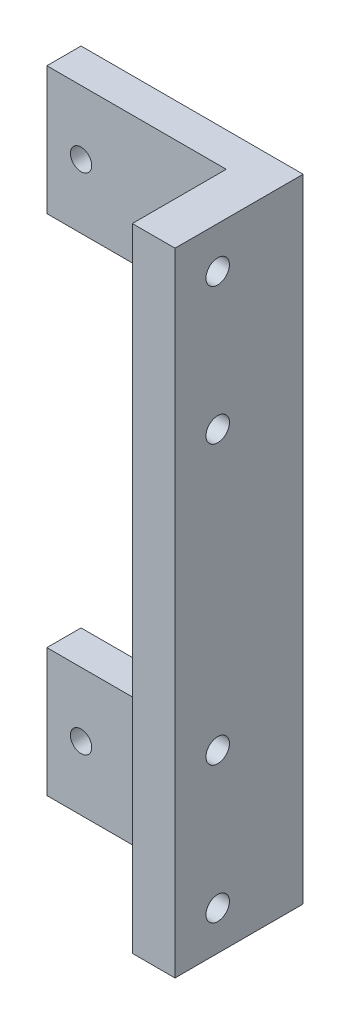
ISO-10303-21;
HEADER;
FILE_DESCRIPTION(('STEP AP214'),'2;1');
FILE_NAME('part.step','',(''),(''),'','','');
FILE_SCHEMA(('AUTOMOTIVE_DESIGN { 1 0 10303 214 1 1 1 1 }'));
ENDSEC;
DATA;
#1=APPLICATION_CONTEXT('core data for automotive mechanical design processes');
#2=APPLICATION_PROTOCOL_DEFINITION('international standard','automotive_design',2000,#1);
#3=PRODUCT_CONTEXT('',#1,'mechanical');
#4=PRODUCT('Part','Part','',(#3));
#5=PRODUCT_RELATED_PRODUCT_CATEGORY('part','',(#4));
#6=PRODUCT_DEFINITION_FORMATION('','',#4);
#7=PRODUCT_DEFINITION_CONTEXT('part definition',#1,'design');
#8=PRODUCT_DEFINITION('design','',#6,#7);
#9=PRODUCT_DEFINITION_SHAPE('','',#8);
#10=(LENGTH_UNIT() NAMED_UNIT(*) SI_UNIT(.MILLI.,.METRE.));
#11=(NAMED_UNIT(*) PLANE_ANGLE_UNIT() SI_UNIT($,.RADIAN.));
#12=(NAMED_UNIT(*) SI_UNIT($,.STERADIAN.) SOLID_ANGLE_UNIT());
#13=UNCERTAINTY_MEASURE_WITH_UNIT(LENGTH_MEASURE(1.E-05),#10,'distance_accuracy_value','');
#14=(GEOMETRIC_REPRESENTATION_CONTEXT(3) GLOBAL_UNCERTAINTY_ASSIGNED_CONTEXT((#13)) GLOBAL_UNIT_ASSIGNED_CONTEXT((#10,
#11,#12)) REPRESENTATION_CONTEXT('',''));
#15=CARTESIAN_POINT('',(0.,0.,0.));
#16=DIRECTION('',(0.,0.,1.));
#17=DIRECTION('',(1.,0.,0.));
#18=AXIS2_PLACEMENT_3D('',#15,#16,#17);
#19=CARTESIAN_POINT('',(0.,148.,8.));
#20=DIRECTION('',(0.,-1.,0.));
#21=DIRECTION('',(0.,0.,-1.));
#22=AXIS2_PLACEMENT_3D('',#19,#20,#21);
#23=PLANE('',#22);
#24=DIRECTION('',(-1.,0.,0.));
#25=VECTOR('',#24,1.);
#26=CARTESIAN_POINT('',(0.,148.,0.));
#27=LINE('',#26,#25);
#28=CARTESIAN_POINT('',(52.,148.,0.));
#29=VERTEX_POINT('',#28);
#30=CARTESIAN_POINT('',(0.,148.,0.));
#31=VERTEX_POINT('',#30);
#32=EDGE_CURVE('E114',#29,#31,#27,.T.);
#33=ORIENTED_EDGE('',*,*,#32,.T.);
#34=DIRECTION('',(0.,0.,-1.));
#35=VECTOR('',#34,1.);
#36=CARTESIAN_POINT('',(0.,148.,8.));
#37=LINE('',#36,#35);
#38=CARTESIAN_POINT('',(0.,148.,8.));
#39=VERTEX_POINT('',#38);
#40=EDGE_CURVE('E11',#39,#31,#37,.T.);
#41=ORIENTED_EDGE('',*,*,#40,.F.);
#42=DIRECTION('',(-1.,0.,0.));
#43=VECTOR('',#42,1.);
#44=CARTESIAN_POINT('',(0.,148.,8.));
#45=LINE('',#44,#43);
#46=CARTESIAN_POINT('',(42.,148.,8.));
#47=VERTEX_POINT('',#46);
#48=EDGE_CURVE('E96',#47,#39,#45,.T.);
#49=ORIENTED_EDGE('',*,*,#48,.F.);
#50=DIRECTION('',(0.,0.,-1.));
#51=VECTOR('',#50,1.);
#52=CARTESIAN_POINT('',(42.,148.,30.));
#53=LINE('',#52,#51);
#54=CARTESIAN_POINT('',(42.,148.,30.));
#55=VERTEX_POINT('',#54);
#56=EDGE_CURVE('E142',#55,#47,#53,.T.);
#57=ORIENTED_EDGE('',*,*,#56,.F.);
#58=DIRECTION('',(1.,0.,0.));
#59=VECTOR('',#58,1.);
#60=CARTESIAN_POINT('',(0.,148.,30.));
#61=LINE('',#60,#59);
#62=CARTESIAN_POINT('',(52.,148.,30.));
#63=VERTEX_POINT('',#62);
#64=EDGE_CURVE('E173',#55,#63,#61,.T.);
#65=ORIENTED_EDGE('',*,*,#64,.T.);
#66=DIRECTION('',(0.,0.,-1.));
#67=VECTOR('',#66,1.);
#68=CARTESIAN_POINT('',(52.,148.,30.));
#69=LINE('',#68,#67);
#70=EDGE_CURVE('E149',#63,#29,#69,.T.);
#71=ORIENTED_EDGE('',*,*,#70,.T.);
#72=EDGE_LOOP('',(#33,#41,#49,#57,#65,#71));
#73=FACE_BOUND('',#72,.T.);
#74=ADVANCED_FACE('F40',(#73),#23,.F.);
#75=CARTESIAN_POINT('',(0.,0.,8.));
#76=DIRECTION('',(1.,0.,0.));
#77=DIRECTION('',(0.,1.,0.));
#78=AXIS2_PLACEMENT_3D('',#75,#76,#77);
#79=PLANE('',#78);
#80=DIRECTION('',(0.,-1.,0.));
#81=VECTOR('',#80,1.);
#82=CARTESIAN_POINT('',(0.,0.,0.));
#83=LINE('',#82,#81);
#84=CARTESIAN_POINT('',(0.,118.,0.));
#85=VERTEX_POINT('',#84);
#86=EDGE_CURVE('E73',#31,#85,#83,.T.);
#87=ORIENTED_EDGE('',*,*,#86,.T.);
#88=DIRECTION('',(0.,0.,-1.));
#89=VECTOR('',#88,1.);
#90=CARTESIAN_POINT('',(0.,118.,8.));
#91=LINE('',#90,#89);
#92=CARTESIAN_POINT('',(0.,118.,8.));
#93=VERTEX_POINT('',#92);
#94=EDGE_CURVE('E51',#93,#85,#91,.T.);
#95=ORIENTED_EDGE('',*,*,#94,.F.);
#96=DIRECTION('',(0.,-1.,0.));
#97=VECTOR('',#96,1.);
#98=CARTESIAN_POINT('',(0.,0.,8.));
#99=LINE('',#98,#97);
#100=EDGE_CURVE('E91',#39,#93,#99,.T.);
#101=ORIENTED_EDGE('',*,*,#100,.F.);
#102=ORIENTED_EDGE('',*,*,#40,.T.);
#103=EDGE_LOOP('',(#87,#95,#101,#102));
#104=FACE_BOUND('',#103,.T.);
#105=ADVANCED_FACE('F101',(#104),#79,.F.);
#106=CARTESIAN_POINT('',(0.,118.,8.));
#107=DIRECTION('',(0.,-1.,0.));
#108=DIRECTION('',(0.,0.,-1.));
#109=AXIS2_PLACEMENT_3D('',#106,#107,#108);
#110=PLANE('',#109);
#111=DIRECTION('',(-1.,0.,0.));
#112=VECTOR('',#111,1.);
#113=CARTESIAN_POINT('',(0.,118.,0.));
#114=LINE('',#113,#112);
#115=CARTESIAN_POINT('',(42.,118.,0.));
#116=VERTEX_POINT('',#115);
#117=EDGE_CURVE('E121',#116,#85,#114,.T.);
#118=ORIENTED_EDGE('',*,*,#117,.F.);
#119=DIRECTION('',(0.,0.,-1.));
#120=VECTOR('',#119,1.);
#121=CARTESIAN_POINT('',(42.,118.,8.));
#122=LINE('',#121,#120);
#123=CARTESIAN_POINT('',(42.,118.,8.));
#124=VERTEX_POINT('',#123);
#125=EDGE_CURVE('E104',#124,#116,#122,.T.);
#126=ORIENTED_EDGE('',*,*,#125,.F.);
#127=DIRECTION('',(-1.,0.,0.));
#128=VECTOR('',#127,1.);
#129=CARTESIAN_POINT('',(0.,118.,8.));
#130=LINE('',#129,#128);
#131=EDGE_CURVE('E95',#124,#93,#130,.T.);
#132=ORIENTED_EDGE('',*,*,#131,.T.);
#133=ORIENTED_EDGE('',*,*,#94,.T.);
#134=EDGE_LOOP('',(#118,#126,#132,#133));
#135=FACE_BOUND('',#134,.T.);
#136=ADVANCED_FACE('F106',(#135),#110,.T.);
#137=CARTESIAN_POINT('',(0.,0.,8.));
#138=DIRECTION('',(0.,0.,1.));
#139=DIRECTION('',(1.,0.,0.));
#140=AXIS2_PLACEMENT_3D('',#137,#138,#139);
#141=PLANE('',#140);
#142=CARTESIAN_POINT('',(34.,133.,8.));
#143=DIRECTION('',(0.,0.,1.));
#144=DIRECTION('',(1.,0.,0.));
#145=AXIS2_PLACEMENT_3D('',#142,#143,#144);
#146=CIRCLE('',#145,2.5);
#147=CARTESIAN_POINT('',(36.5,133.,8.));
#148=VERTEX_POINT('',#147);
#149=EDGE_CURVE('E230',#148,#148,#146,.T.);
#150=ORIENTED_EDGE('',*,*,#149,.F.);
#151=EDGE_LOOP('',(#150));
#152=FACE_BOUND('',#151,.T.);
#153=CARTESIAN_POINT('',(7.99999999999999,133.,8.));
#154=DIRECTION('',(0.,0.,1.));
#155=DIRECTION('',(1.,0.,0.));
#156=AXIS2_PLACEMENT_3D('',#153,#154,#155);
#157=CIRCLE('',#156,2.5);
#158=CARTESIAN_POINT('',(10.5,133.,8.));
#159=VERTEX_POINT('',#158);
#160=EDGE_CURVE('E222',#159,#159,#157,.T.);
#161=ORIENTED_EDGE('',*,*,#160,.F.);
#162=EDGE_LOOP('',(#161));
#163=FACE_BOUND('',#162,.T.);
#164=ORIENTED_EDGE('',*,*,#48,.T.);
#165=ORIENTED_EDGE('',*,*,#100,.T.);
#166=ORIENTED_EDGE('',*,*,#131,.F.);
#167=DIRECTION('',(0.,1.,0.));
#168=VECTOR('',#167,1.);
#169=CARTESIAN_POINT('',(42.,0.,8.));
#170=LINE('',#169,#168);
#171=EDGE_CURVE('E60',#124,#47,#170,.T.);
#172=ORIENTED_EDGE('',*,*,#171,.T.);
#173=EDGE_LOOP('',(#164,#165,#166,#172));
#174=FACE_BOUND('',#173,.T.);
#175=ADVANCED_FACE('F93',(#152,#163,#174),#141,.T.);
#176=CARTESIAN_POINT('',(0.,0.,0.));
#177=DIRECTION('',(0.,0.,1.));
#178=DIRECTION('',(1.,0.,0.));
#179=AXIS2_PLACEMENT_3D('',#176,#177,#178);
#180=PLANE('',#179);
#181=CARTESIAN_POINT('',(7.99999999999999,15.,0.));
#182=DIRECTION('',(0.,0.,1.));
#183=DIRECTION('',(1.,0.,0.));
#184=AXIS2_PLACEMENT_3D('',#181,#182,#183);
#185=CIRCLE('',#184,2.5);
#186=CARTESIAN_POINT('',(10.5,15.,0.));
#187=VERTEX_POINT('',#186);
#188=EDGE_CURVE('E242',#187,#187,#185,.F.);
#189=ORIENTED_EDGE('',*,*,#188,.F.);
#190=EDGE_LOOP('',(#189));
#191=FACE_BOUND('',#190,.T.);
#192=CARTESIAN_POINT('',(34.,15.,0.));
#193=DIRECTION('',(0.,0.,1.));
#194=DIRECTION('',(1.,0.,0.));
#195=AXIS2_PLACEMENT_3D('',#192,#193,#194);
#196=CIRCLE('',#195,2.5);
#197=CARTESIAN_POINT('',(36.5,15.,0.));
#198=VERTEX_POINT('',#197);
#199=EDGE_CURVE('E234',#198,#198,#196,.F.);
#200=ORIENTED_EDGE('',*,*,#199,.F.);
#201=EDGE_LOOP('',(#200));
#202=FACE_BOUND('',#201,.T.);
#203=CARTESIAN_POINT('',(34.,133.,0.));
#204=DIRECTION('',(0.,0.,1.));
#205=DIRECTION('',(1.,0.,0.));
#206=AXIS2_PLACEMENT_3D('',#203,#204,#205);
#207=CIRCLE('',#206,2.5);
#208=CARTESIAN_POINT('',(36.5,133.,0.));
#209=VERTEX_POINT('',#208);
#210=EDGE_CURVE('E226',#209,#209,#207,.F.);
#211=ORIENTED_EDGE('',*,*,#210,.F.);
#212=EDGE_LOOP('',(#211));
#213=FACE_BOUND('',#212,.T.);
#214=CARTESIAN_POINT('',(7.99999999999999,133.,0.));
#215=DIRECTION('',(0.,0.,1.));
#216=DIRECTION('',(1.,0.,0.));
#217=AXIS2_PLACEMENT_3D('',#214,#215,#216);
#218=CIRCLE('',#217,2.5);
#219=CARTESIAN_POINT('',(10.5,133.,0.));
#220=VERTEX_POINT('',#219);
#221=EDGE_CURVE('E204',#220,#220,#218,.F.);
#222=ORIENTED_EDGE('',*,*,#221,.F.);
#223=EDGE_LOOP('',(#222));
#224=FACE_BOUND('',#223,.T.);
#225=ORIENTED_EDGE('',*,*,#32,.F.);
#226=DIRECTION('',(0.,1.,0.));
#227=VECTOR('',#226,1.);
#228=CARTESIAN_POINT('',(52.,0.,0.));
#229=LINE('',#228,#227);
#230=CARTESIAN_POINT('',(52.,0.,0.));
#231=VERTEX_POINT('',#230);
#232=EDGE_CURVE('E162',#231,#29,#229,.T.);
#233=ORIENTED_EDGE('',*,*,#232,.F.);
#234=DIRECTION('',(1.,0.,0.));
#235=VECTOR('',#234,1.);
#236=CARTESIAN_POINT('',(0.,0.,0.));
#237=LINE('',#236,#235);
#238=CARTESIAN_POINT('',(0.,0.,0.));
#239=VERTEX_POINT('',#238);
#240=EDGE_CURVE('E166',#239,#231,#237,.T.);
#241=ORIENTED_EDGE('',*,*,#240,.F.);
#242=DIRECTION('',(0.,1.,0.));
#243=VECTOR('',#242,1.);
#244=CARTESIAN_POINT('',(0.,0.,0.));
#245=LINE('',#244,#243);
#246=CARTESIAN_POINT('',(0.,30.,0.));
#247=VERTEX_POINT('',#246);
#248=EDGE_CURVE('E196',#239,#247,#245,.T.);
#249=ORIENTED_EDGE('',*,*,#248,.T.);
#250=DIRECTION('',(1.,0.,0.));
#251=VECTOR('',#250,1.);
#252=CARTESIAN_POINT('',(0.,30.,0.));
#253=LINE('',#252,#251);
#254=CARTESIAN_POINT('',(42.,30.,0.));
#255=VERTEX_POINT('',#254);
#256=EDGE_CURVE('E201',#247,#255,#253,.T.);
#257=ORIENTED_EDGE('',*,*,#256,.T.);
#258=DIRECTION('',(0.,1.,0.));
#259=VECTOR('',#258,1.);
#260=CARTESIAN_POINT('',(42.,0.,0.));
#261=LINE('',#260,#259);
#262=EDGE_CURVE('E43',#255,#116,#261,.T.);
#263=ORIENTED_EDGE('',*,*,#262,.T.);
#264=ORIENTED_EDGE('',*,*,#117,.T.);
#265=ORIENTED_EDGE('',*,*,#86,.F.);
#266=EDGE_LOOP('',(#225,#233,#241,#249,#257,#263,#264,#265));
#267=FACE_BOUND('',#266,.T.);
#268=ADVANCED_FACE('F134',(#191,#202,#213,#224,#267),#180,.F.);
#269=CARTESIAN_POINT('',(42.,0.,30.));
#270=DIRECTION('',(-1.,0.,0.));
#271=DIRECTION('',(0.,-1.,0.));
#272=AXIS2_PLACEMENT_3D('',#269,#270,#271);
#273=PLANE('',#272);
#274=CARTESIAN_POINT('',(42.,9.20000000000001,20.));
#275=DIRECTION('',(-1.,0.,0.));
#276=DIRECTION('',(0.,-1.,0.));
#277=AXIS2_PLACEMENT_3D('',#274,#275,#276);
#278=CIRCLE('',#277,2.75);
#279=CARTESIAN_POINT('',(42.,6.45000000000002,20.));
#280=VERTEX_POINT('',#279);
#281=EDGE_CURVE('E274',#280,#280,#278,.F.);
#282=ORIENTED_EDGE('',*,*,#281,.T.);
#283=EDGE_LOOP('',(#282));
#284=FACE_BOUND('',#283,.T.);
#285=CARTESIAN_POINT('',(42.,41.2,20.));
#286=DIRECTION('',(-1.,0.,0.));
#287=DIRECTION('',(0.,-1.,0.));
#288=AXIS2_PLACEMENT_3D('',#285,#286,#287);
#289=CIRCLE('',#288,2.75);
#290=CARTESIAN_POINT('',(42.,38.45,20.));
#291=VERTEX_POINT('',#290);
#292=EDGE_CURVE('E266',#291,#291,#289,.F.);
#293=ORIENTED_EDGE('',*,*,#292,.T.);
#294=EDGE_LOOP('',(#293));
#295=FACE_BOUND('',#294,.T.);
#296=CARTESIAN_POINT('',(42.,106.3,20.));
#297=DIRECTION('',(-1.,0.,0.));
#298=DIRECTION('',(0.,-1.,0.));
#299=AXIS2_PLACEMENT_3D('',#296,#297,#298);
#300=CIRCLE('',#299,2.75);
#301=CARTESIAN_POINT('',(42.,103.55,20.));
#302=VERTEX_POINT('',#301);
#303=EDGE_CURVE('E258',#302,#302,#300,.F.);
#304=ORIENTED_EDGE('',*,*,#303,.T.);
#305=EDGE_LOOP('',(#304));
#306=FACE_BOUND('',#305,.T.);
#307=CARTESIAN_POINT('',(42.,138.3,20.));
#308=DIRECTION('',(-1.,0.,0.));
#309=DIRECTION('',(0.,-1.,0.));
#310=AXIS2_PLACEMENT_3D('',#307,#308,#309);
#311=CIRCLE('',#310,2.75);
#312=CARTESIAN_POINT('',(42.,135.55,20.));
#313=VERTEX_POINT('',#312);
#314=EDGE_CURVE('E250',#313,#313,#311,.F.);
#315=ORIENTED_EDGE('',*,*,#314,.T.);
#316=EDGE_LOOP('',(#315));
#317=FACE_BOUND('',#316,.T.);
#318=DIRECTION('',(0.,0.,-1.));
#319=VECTOR('',#318,1.);
#320=CARTESIAN_POINT('',(42.,30.,8.));
#321=LINE('',#320,#319);
#322=CARTESIAN_POINT('',(42.,30.,8.));
#323=VERTEX_POINT('',#322);
#324=EDGE_CURVE('E170',#323,#255,#321,.T.);
#325=ORIENTED_EDGE('',*,*,#324,.F.);
#326=DIRECTION('',(0.,1.,0.));
#327=VECTOR('',#326,1.);
#328=CARTESIAN_POINT('',(42.,0.,8.));
#329=LINE('',#328,#327);
#330=CARTESIAN_POINT('',(42.,0.,8.));
#331=VERTEX_POINT('',#330);
#332=EDGE_CURVE('E212',#331,#323,#329,.T.);
#333=ORIENTED_EDGE('',*,*,#332,.F.);
#334=DIRECTION('',(0.,0.,-1.));
#335=VECTOR('',#334,1.);
#336=CARTESIAN_POINT('',(42.,0.,30.));
#337=LINE('',#336,#335);
#338=CARTESIAN_POINT('',(42.,0.,30.));
#339=VERTEX_POINT('',#338);
#340=EDGE_CURVE('E150',#339,#331,#337,.T.);
#341=ORIENTED_EDGE('',*,*,#340,.F.);
#342=DIRECTION('',(0.,1.,0.));
#343=VECTOR('',#342,1.);
#344=CARTESIAN_POINT('',(42.,0.,30.));
#345=LINE('',#344,#343);
#346=EDGE_CURVE('E144',#339,#55,#345,.T.);
#347=ORIENTED_EDGE('',*,*,#346,.T.);
#348=ORIENTED_EDGE('',*,*,#56,.T.);
#349=ORIENTED_EDGE('',*,*,#171,.F.);
#350=ORIENTED_EDGE('',*,*,#125,.T.);
#351=ORIENTED_EDGE('',*,*,#262,.F.);
#352=EDGE_LOOP('',(#325,#333,#341,#347,#348,#349,#350,#351));
#353=FACE_BOUND('',#352,.T.);
#354=ADVANCED_FACE('F137',(#284,#295,#306,#317,#353),#273,.T.);
#355=CARTESIAN_POINT('',(0.,0.,30.));
#356=DIRECTION('',(0.,1.,0.));
#357=DIRECTION('',(0.,0.,1.));
#358=AXIS2_PLACEMENT_3D('',#355,#356,#357);
#359=PLANE('',#358);
#360=ORIENTED_EDGE('',*,*,#240,.T.);
#361=DIRECTION('',(0.,0.,-1.));
#362=VECTOR('',#361,1.);
#363=CARTESIAN_POINT('',(52.,0.,30.));
#364=LINE('',#363,#362);
#365=CARTESIAN_POINT('',(52.,0.,30.));
#366=VERTEX_POINT('',#365);
#367=EDGE_CURVE('E118',#366,#231,#364,.T.);
#368=ORIENTED_EDGE('',*,*,#367,.F.);
#369=DIRECTION('',(1.,0.,0.));
#370=VECTOR('',#369,1.);
#371=CARTESIAN_POINT('',(0.,0.,30.));
#372=LINE('',#371,#370);
#373=EDGE_CURVE('E180',#339,#366,#372,.T.);
#374=ORIENTED_EDGE('',*,*,#373,.F.);
#375=ORIENTED_EDGE('',*,*,#340,.T.);
#376=DIRECTION('',(1.,0.,0.));
#377=VECTOR('',#376,1.);
#378=CARTESIAN_POINT('',(0.,0.,8.));
#379=LINE('',#378,#377);
#380=CARTESIAN_POINT('',(0.,0.,8.));
#381=VERTEX_POINT('',#380);
#382=EDGE_CURVE('E200',#381,#331,#379,.T.);
#383=ORIENTED_EDGE('',*,*,#382,.F.);
#384=DIRECTION('',(0.,0.,-1.));
#385=VECTOR('',#384,1.);
#386=CARTESIAN_POINT('',(0.,0.,8.));
#387=LINE('',#386,#385);
#388=EDGE_CURVE('E191',#381,#239,#387,.T.);
#389=ORIENTED_EDGE('',*,*,#388,.T.);
#390=EDGE_LOOP('',(#360,#368,#374,#375,#383,#389));
#391=FACE_BOUND('',#390,.T.);
#392=ADVANCED_FACE('F290',(#391),#359,.F.);
#393=CARTESIAN_POINT('',(52.,0.,30.));
#394=DIRECTION('',(-1.,0.,0.));
#395=DIRECTION('',(0.,0.,1.));
#396=AXIS2_PLACEMENT_3D('',#393,#394,#395);
#397=PLANE('',#396);
#398=CARTESIAN_POINT('',(52.,9.20000000000001,20.));
#399=DIRECTION('',(1.,0.,0.));
#400=DIRECTION('',(0.,0.,1.));
#401=AXIS2_PLACEMENT_3D('',#398,#399,#400);
#402=CIRCLE('',#401,2.75);
#403=CARTESIAN_POINT('',(52.,9.20000000000001,22.75));
#404=VERTEX_POINT('',#403);
#405=EDGE_CURVE('E278',#404,#404,#402,.T.);
#406=ORIENTED_EDGE('',*,*,#405,.F.);
#407=EDGE_LOOP('',(#406));
#408=FACE_BOUND('',#407,.T.);
#409=CARTESIAN_POINT('',(52.,41.2,20.));
#410=DIRECTION('',(1.,0.,0.));
#411=DIRECTION('',(0.,0.,1.));
#412=AXIS2_PLACEMENT_3D('',#409,#410,#411);
#413=CIRCLE('',#412,2.75);
#414=CARTESIAN_POINT('',(52.,41.2,22.75));
#415=VERTEX_POINT('',#414);
#416=EDGE_CURVE('E270',#415,#415,#413,.T.);
#417=ORIENTED_EDGE('',*,*,#416,.F.);
#418=EDGE_LOOP('',(#417));
#419=FACE_BOUND('',#418,.T.);
#420=CARTESIAN_POINT('',(52.,106.3,20.));
#421=DIRECTION('',(1.,0.,0.));
#422=DIRECTION('',(0.,0.,-1.));
#423=AXIS2_PLACEMENT_3D('',#420,#421,#422);
#424=CIRCLE('',#423,2.75);
#425=CARTESIAN_POINT('',(52.,106.3,17.25));
#426=VERTEX_POINT('',#425);
#427=EDGE_CURVE('E262',#426,#426,#424,.T.);
#428=ORIENTED_EDGE('',*,*,#427,.F.);
#429=EDGE_LOOP('',(#428));
#430=FACE_BOUND('',#429,.T.);
#431=CARTESIAN_POINT('',(52.,138.3,20.));
#432=DIRECTION('',(1.,0.,0.));
#433=DIRECTION('',(0.,0.,-1.));
#434=AXIS2_PLACEMENT_3D('',#431,#432,#433);
#435=CIRCLE('',#434,2.75);
#436=CARTESIAN_POINT('',(52.,138.3,17.25));
#437=VERTEX_POINT('',#436);
#438=EDGE_CURVE('E254',#437,#437,#435,.T.);
#439=ORIENTED_EDGE('',*,*,#438,.F.);
#440=EDGE_LOOP('',(#439));
#441=FACE_BOUND('',#440,.T.);
#442=ORIENTED_EDGE('',*,*,#232,.T.);
#443=ORIENTED_EDGE('',*,*,#70,.F.);
#444=DIRECTION('',(0.,1.,0.));
#445=VECTOR('',#444,1.);
#446=CARTESIAN_POINT('',(52.,0.,30.));
#447=LINE('',#446,#445);
#448=EDGE_CURVE('E176',#366,#63,#447,.T.);
#449=ORIENTED_EDGE('',*,*,#448,.F.);
#450=ORIENTED_EDGE('',*,*,#367,.T.);
#451=EDGE_LOOP('',(#442,#443,#449,#450));
#452=FACE_BOUND('',#451,.T.);
#453=ADVANCED_FACE('F286',(#408,#419,#430,#441,#452),#397,.F.);
#454=CARTESIAN_POINT('',(0.,0.,30.));
#455=DIRECTION('',(0.,0.,1.));
#456=DIRECTION('',(1.,0.,0.));
#457=AXIS2_PLACEMENT_3D('',#454,#455,#456);
#458=PLANE('',#457);
#459=ORIENTED_EDGE('',*,*,#373,.T.);
#460=ORIENTED_EDGE('',*,*,#448,.T.);
#461=ORIENTED_EDGE('',*,*,#64,.F.);
#462=ORIENTED_EDGE('',*,*,#346,.F.);
#463=EDGE_LOOP('',(#459,#460,#461,#462));
#464=FACE_BOUND('',#463,.T.);
#465=ADVANCED_FACE('F289',(#464),#458,.T.);
#466=CARTESIAN_POINT('',(0.,30.,8.));
#467=DIRECTION('',(0.,1.,0.));
#468=DIRECTION('',(0.,0.,1.));
#469=AXIS2_PLACEMENT_3D('',#466,#467,#468);
#470=PLANE('',#469);
#471=ORIENTED_EDGE('',*,*,#256,.F.);
#472=DIRECTION('',(0.,0.,-1.));
#473=VECTOR('',#472,1.);
#474=CARTESIAN_POINT('',(0.,30.,8.));
#475=LINE('',#474,#473);
#476=CARTESIAN_POINT('',(0.,30.,8.));
#477=VERTEX_POINT('',#476);
#478=EDGE_CURVE('E187',#477,#247,#475,.T.);
#479=ORIENTED_EDGE('',*,*,#478,.F.);
#480=DIRECTION('',(1.,0.,0.));
#481=VECTOR('',#480,1.);
#482=CARTESIAN_POINT('',(0.,30.,8.));
#483=LINE('',#482,#481);
#484=EDGE_CURVE('E208',#477,#323,#483,.T.);
#485=ORIENTED_EDGE('',*,*,#484,.T.);
#486=ORIENTED_EDGE('',*,*,#324,.T.);
#487=EDGE_LOOP('',(#471,#479,#485,#486));
#488=FACE_BOUND('',#487,.T.);
#489=ADVANCED_FACE('F356',(#488),#470,.T.);
#490=CARTESIAN_POINT('',(0.,0.,8.));
#491=DIRECTION('',(-1.,0.,0.));
#492=DIRECTION('',(0.,0.,1.));
#493=AXIS2_PLACEMENT_3D('',#490,#491,#492);
#494=PLANE('',#493);
#495=ORIENTED_EDGE('',*,*,#248,.F.);
#496=ORIENTED_EDGE('',*,*,#388,.F.);
#497=DIRECTION('',(0.,1.,0.));
#498=VECTOR('',#497,1.);
#499=CARTESIAN_POINT('',(0.,0.,8.));
#500=LINE('',#499,#498);
#501=EDGE_CURVE('E195',#381,#477,#500,.T.);
#502=ORIENTED_EDGE('',*,*,#501,.T.);
#503=ORIENTED_EDGE('',*,*,#478,.T.);
#504=EDGE_LOOP('',(#495,#496,#502,#503));
#505=FACE_BOUND('',#504,.T.);
#506=ADVANCED_FACE('F359',(#505),#494,.T.);
#507=CARTESIAN_POINT('',(0.,0.,8.));
#508=DIRECTION('',(0.,0.,1.));
#509=DIRECTION('',(1.,0.,0.));
#510=AXIS2_PLACEMENT_3D('',#507,#508,#509);
#511=PLANE('',#510);
#512=CARTESIAN_POINT('',(7.99999999999999,15.,8.));
#513=DIRECTION('',(0.,0.,1.));
#514=DIRECTION('',(-1.,0.,0.));
#515=AXIS2_PLACEMENT_3D('',#512,#513,#514);
#516=CIRCLE('',#515,2.5);
#517=CARTESIAN_POINT('',(5.49999999999999,15.,8.));
#518=VERTEX_POINT('',#517);
#519=EDGE_CURVE('E246',#518,#518,#516,.T.);
#520=ORIENTED_EDGE('',*,*,#519,.F.);
#521=EDGE_LOOP('',(#520));
#522=FACE_BOUND('',#521,.T.);
#523=CARTESIAN_POINT('',(34.,15.,8.));
#524=DIRECTION('',(0.,0.,1.));
#525=DIRECTION('',(-1.,0.,0.));
#526=AXIS2_PLACEMENT_3D('',#523,#524,#525);
#527=CIRCLE('',#526,2.5);
#528=CARTESIAN_POINT('',(31.5,15.,8.));
#529=VERTEX_POINT('',#528);
#530=EDGE_CURVE('E238',#529,#529,#527,.T.);
#531=ORIENTED_EDGE('',*,*,#530,.F.);
#532=EDGE_LOOP('',(#531));
#533=FACE_BOUND('',#532,.T.);
#534=ORIENTED_EDGE('',*,*,#382,.T.);
#535=ORIENTED_EDGE('',*,*,#332,.T.);
#536=ORIENTED_EDGE('',*,*,#484,.F.);
#537=ORIENTED_EDGE('',*,*,#501,.F.);
#538=EDGE_LOOP('',(#534,#535,#536,#537));
#539=FACE_BOUND('',#538,.T.);
#540=ADVANCED_FACE('F329',(#522,#533,#539),#511,.T.);
#541=CARTESIAN_POINT('',(7.99999999999999,133.,-7.07106781186548));
#542=DIRECTION('',(0.,0.,1.));
#543=DIRECTION('',(1.,0.,0.));
#544=AXIS2_PLACEMENT_3D('',#541,#542,#543);
#545=CYLINDRICAL_SURFACE('',#544,2.5);
#546=ORIENTED_EDGE('',*,*,#221,.T.);
#547=EDGE_LOOP('',(#546));
#548=FACE_BOUND('',#547,.T.);
#549=ORIENTED_EDGE('',*,*,#160,.T.);
#550=EDGE_LOOP('',(#549));
#551=FACE_BOUND('',#550,.T.);
#552=ADVANCED_FACE('F366',(#548,#551),#545,.F.);
#553=CARTESIAN_POINT('',(34.,133.,-7.07106781186548));
#554=DIRECTION('',(0.,0.,1.));
#555=DIRECTION('',(1.,0.,0.));
#556=AXIS2_PLACEMENT_3D('',#553,#554,#555);
#557=CYLINDRICAL_SURFACE('',#556,2.5);
#558=ORIENTED_EDGE('',*,*,#210,.T.);
#559=EDGE_LOOP('',(#558));
#560=FACE_BOUND('',#559,.T.);
#561=ORIENTED_EDGE('',*,*,#149,.T.);
#562=EDGE_LOOP('',(#561));
#563=FACE_BOUND('',#562,.T.);
#564=ADVANCED_FACE('F370',(#560,#563),#557,.F.);
#565=CARTESIAN_POINT('',(34.,15.,-7.07106781186548));
#566=DIRECTION('',(0.,0.,1.));
#567=DIRECTION('',(1.,0.,0.));
#568=AXIS2_PLACEMENT_3D('',#565,#566,#567);
#569=CYLINDRICAL_SURFACE('',#568,2.5);
#570=ORIENTED_EDGE('',*,*,#199,.T.);
#571=EDGE_LOOP('',(#570));
#572=FACE_BOUND('',#571,.T.);
#573=ORIENTED_EDGE('',*,*,#530,.T.);
#574=EDGE_LOOP('',(#573));
#575=FACE_BOUND('',#574,.T.);
#576=ADVANCED_FACE('F374',(#572,#575),#569,.F.);
#577=CARTESIAN_POINT('',(7.99999999999999,15.,-7.07106781186548));
#578=DIRECTION('',(0.,0.,1.));
#579=DIRECTION('',(1.,0.,0.));
#580=AXIS2_PLACEMENT_3D('',#577,#578,#579);
#581=CYLINDRICAL_SURFACE('',#580,2.5);
#582=ORIENTED_EDGE('',*,*,#188,.T.);
#583=EDGE_LOOP('',(#582));
#584=FACE_BOUND('',#583,.T.);
#585=ORIENTED_EDGE('',*,*,#519,.T.);
#586=EDGE_LOOP('',(#585));
#587=FACE_BOUND('',#586,.T.);
#588=ADVANCED_FACE('F378',(#584,#587),#581,.F.);
#589=CARTESIAN_POINT('',(34.221825406948,138.3,20.));
#590=DIRECTION('',(1.,0.,0.));
#591=DIRECTION('',(0.,0.,-1.));
#592=AXIS2_PLACEMENT_3D('',#589,#590,#591);
#593=CYLINDRICAL_SURFACE('',#592,2.75);
#594=ORIENTED_EDGE('',*,*,#438,.T.);
#595=EDGE_LOOP('',(#594));
#596=FACE_BOUND('',#595,.T.);
#597=ORIENTED_EDGE('',*,*,#314,.F.);
#598=EDGE_LOOP('',(#597));
#599=FACE_BOUND('',#598,.T.);
#600=ADVANCED_FACE('F382',(#596,#599),#593,.F.);
#601=CARTESIAN_POINT('',(34.221825406948,106.3,20.));
#602=DIRECTION('',(1.,0.,0.));
#603=DIRECTION('',(0.,0.,-1.));
#604=AXIS2_PLACEMENT_3D('',#601,#602,#603);
#605=CYLINDRICAL_SURFACE('',#604,2.75);
#606=ORIENTED_EDGE('',*,*,#427,.T.);
#607=EDGE_LOOP('',(#606));
#608=FACE_BOUND('',#607,.T.);
#609=ORIENTED_EDGE('',*,*,#303,.F.);
#610=EDGE_LOOP('',(#609));
#611=FACE_BOUND('',#610,.T.);
#612=ADVANCED_FACE('F386',(#608,#611),#605,.F.);
#613=CARTESIAN_POINT('',(34.221825406948,41.2,20.));
#614=DIRECTION('',(1.,0.,0.));
#615=DIRECTION('',(0.,0.,-1.));
#616=AXIS2_PLACEMENT_3D('',#613,#614,#615);
#617=CYLINDRICAL_SURFACE('',#616,2.75);
#618=ORIENTED_EDGE('',*,*,#416,.T.);
#619=EDGE_LOOP('',(#618));
#620=FACE_BOUND('',#619,.T.);
#621=ORIENTED_EDGE('',*,*,#292,.F.);
#622=EDGE_LOOP('',(#621));
#623=FACE_BOUND('',#622,.T.);
#624=ADVANCED_FACE('F390',(#620,#623),#617,.F.);
#625=CARTESIAN_POINT('',(34.221825406948,9.20000000000001,20.));
#626=DIRECTION('',(1.,0.,0.));
#627=DIRECTION('',(0.,0.,-1.));
#628=AXIS2_PLACEMENT_3D('',#625,#626,#627);
#629=CYLINDRICAL_SURFACE('',#628,2.75);
#630=ORIENTED_EDGE('',*,*,#405,.T.);
#631=EDGE_LOOP('',(#630));
#632=FACE_BOUND('',#631,.T.);
#633=ORIENTED_EDGE('',*,*,#281,.F.);
#634=EDGE_LOOP('',(#633));
#635=FACE_BOUND('',#634,.T.);
#636=ADVANCED_FACE('F283',(#632,#635),#629,.F.);
#637=CLOSED_SHELL('',(#74,#105,#136,#175,#268,#354,#392,#453,#465,#489,#506,#540,#552,#564,#576,
#588,#600,#612,#624,#636));
#638=MANIFOLD_SOLID_BREP('B2',#637);
#639=ADVANCED_BREP_SHAPE_REPRESENTATION('',(#18,#638),#14);
#640=SHAPE_DEFINITION_REPRESENTATION(#9,#639);
ENDSEC;
END-ISO-10303-21;
